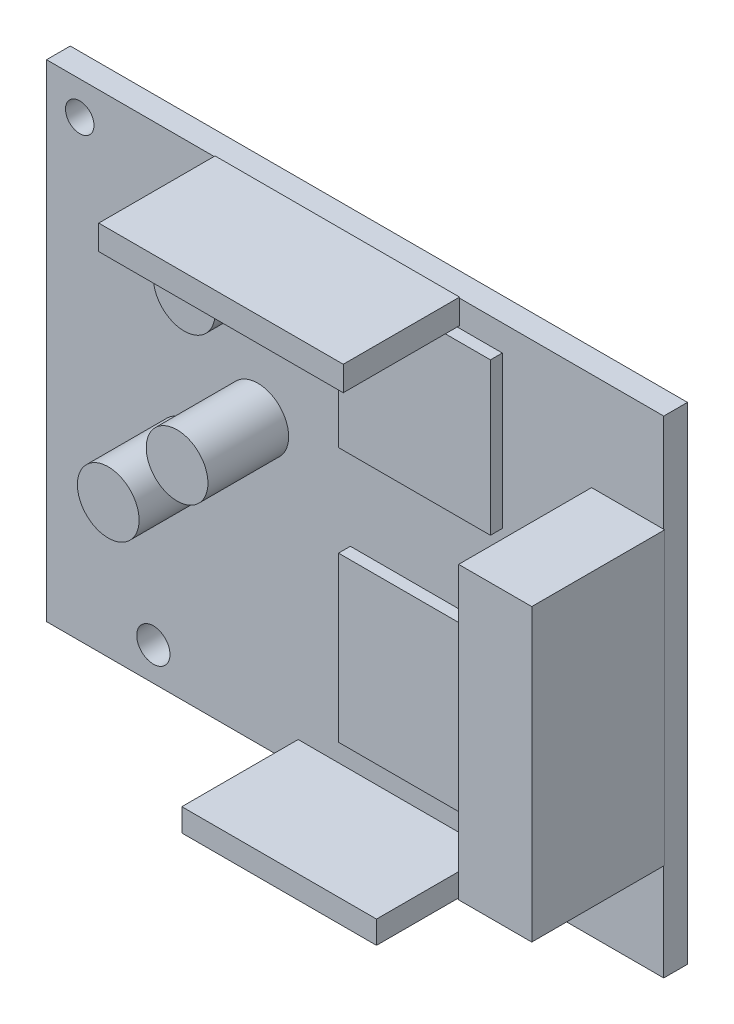
ISO-10303-21;
HEADER;
FILE_DESCRIPTION(('STEP AP214'),'2;1');
FILE_NAME('part.step','',(''),(''),'','','');
FILE_SCHEMA(('AUTOMOTIVE_DESIGN { 1 0 10303 214 1 1 1 1 }'));
ENDSEC;
DATA;
#1=APPLICATION_CONTEXT('core data for automotive mechanical design processes');
#2=APPLICATION_PROTOCOL_DEFINITION('international standard','automotive_design',2000,#1);
#3=PRODUCT_CONTEXT('',#1,'mechanical');
#4=PRODUCT('Part','Part','',(#3));
#5=PRODUCT_RELATED_PRODUCT_CATEGORY('part','',(#4));
#6=PRODUCT_DEFINITION_FORMATION('','',#4);
#7=PRODUCT_DEFINITION_CONTEXT('part definition',#1,'design');
#8=PRODUCT_DEFINITION('design','',#6,#7);
#9=PRODUCT_DEFINITION_SHAPE('','',#8);
#10=(LENGTH_UNIT() NAMED_UNIT(*) SI_UNIT(.MILLI.,.METRE.));
#11=(NAMED_UNIT(*) PLANE_ANGLE_UNIT() SI_UNIT($,.RADIAN.));
#12=(NAMED_UNIT(*) SI_UNIT($,.STERADIAN.) SOLID_ANGLE_UNIT());
#13=UNCERTAINTY_MEASURE_WITH_UNIT(LENGTH_MEASURE(1.E-05),#10,'distance_accuracy_value','');
#14=(GEOMETRIC_REPRESENTATION_CONTEXT(3) GLOBAL_UNCERTAINTY_ASSIGNED_CONTEXT((#13)) GLOBAL_UNIT_ASSIGNED_CONTEXT((#10,
#11,#12)) REPRESENTATION_CONTEXT('',''));
#15=CARTESIAN_POINT('',(0.,0.,0.));
#16=DIRECTION('',(0.,0.,1.));
#17=DIRECTION('',(1.,0.,0.));
#18=AXIS2_PLACEMENT_3D('',#15,#16,#17);
#19=CARTESIAN_POINT('',(0.,0.,0.));
#20=DIRECTION('',(0.,0.,1.));
#21=DIRECTION('',(1.,0.,0.));
#22=AXIS2_PLACEMENT_3D('',#19,#20,#21);
#23=PLANE('',#22);
#24=DIRECTION('',(1.,0.,0.));
#25=VECTOR('',#24,1.);
#26=CARTESIAN_POINT('',(-0.499999999999998,6.875,0.));
#27=LINE('',#26,#25);
#28=CARTESIAN_POINT('',(-0.499999999999998,6.875,0.));
#29=VERTEX_POINT('',#28);
#30=CARTESIAN_POINT('',(15.5,6.875,0.));
#31=VERTEX_POINT('',#30);
#32=EDGE_CURVE('E235',#29,#31,#27,.T.);
#33=ORIENTED_EDGE('',*,*,#32,.F.);
#34=DIRECTION('',(0.,-1.,0.));
#35=VECTOR('',#34,1.);
#36=CARTESIAN_POINT('',(-0.5,22.875,0.));
#37=LINE('',#36,#35);
#38=CARTESIAN_POINT('',(-0.5,22.875,0.));
#39=VERTEX_POINT('',#38);
#40=EDGE_CURVE('E232',#39,#29,#37,.T.);
#41=ORIENTED_EDGE('',*,*,#40,.F.);
#42=DIRECTION('',(-1.,0.,0.));
#43=VECTOR('',#42,1.);
#44=CARTESIAN_POINT('',(-0.5,22.875,0.));
#45=LINE('',#44,#43);
#46=CARTESIAN_POINT('',(15.5,22.875,0.));
#47=VERTEX_POINT('',#46);
#48=EDGE_CURVE('E244',#47,#39,#45,.T.);
#49=ORIENTED_EDGE('',*,*,#48,.F.);
#50=DIRECTION('',(0.,1.,0.));
#51=VECTOR('',#50,1.);
#52=CARTESIAN_POINT('',(15.5,22.875,0.));
#53=LINE('',#52,#51);
#54=EDGE_CURVE('E252',#31,#47,#53,.T.);
#55=ORIENTED_EDGE('',*,*,#54,.F.);
#56=EDGE_LOOP('',(#33,#41,#49,#55));
#57=FACE_BOUND('',#56,.T.);
#58=CARTESIAN_POINT('',(-21.25,-22.125,0.));
#59=DIRECTION('',(0.,0.,1.));
#60=DIRECTION('',(1.,0.,0.));
#61=AXIS2_PLACEMENT_3D('',#58,#59,#60);
#62=CIRCLE('',#61,1.75);
#63=CARTESIAN_POINT('',(-19.5,-22.125,0.));
#64=VERTEX_POINT('',#63);
#65=EDGE_CURVE('E263',#64,#64,#62,.T.);
#66=ORIENTED_EDGE('',*,*,#65,.F.);
#67=EDGE_LOOP('',(#66));
#68=FACE_BOUND('',#67,.T.);
#69=CARTESIAN_POINT('',(-29.,22.125,0.));
#70=DIRECTION('',(0.,0.,1.));
#71=DIRECTION('',(1.,0.,0.));
#72=AXIS2_PLACEMENT_3D('',#69,#70,#71);
#73=CIRCLE('',#72,1.50000000000003);
#74=CARTESIAN_POINT('',(-27.5,22.125,0.));
#75=VERTEX_POINT('',#74);
#76=EDGE_CURVE('E267',#75,#75,#73,.T.);
#77=ORIENTED_EDGE('',*,*,#76,.F.);
#78=EDGE_LOOP('',(#77));
#79=FACE_BOUND('',#78,.T.);
#80=DIRECTION('',(1.,0.,0.));
#81=VECTOR('',#80,1.);
#82=CARTESIAN_POINT('',(32.5,-25.625,0.));
#83=LINE('',#82,#81);
#84=CARTESIAN_POINT('',(-32.5,-25.625,0.));
#85=VERTEX_POINT('',#84);
#86=CARTESIAN_POINT('',(32.5,-25.625,0.));
#87=VERTEX_POINT('',#86);
#88=EDGE_CURVE('E417',#85,#87,#83,.T.);
#89=ORIENTED_EDGE('',*,*,#88,.T.);
#90=DIRECTION('',(0.,1.,0.));
#91=VECTOR('',#90,1.);
#92=CARTESIAN_POINT('',(32.5,-25.625,0.));
#93=LINE('',#92,#91);
#94=CARTESIAN_POINT('',(32.5,-15.3,0.));
#95=VERTEX_POINT('',#94);
#96=EDGE_CURVE('E420',#87,#95,#93,.T.);
#97=ORIENTED_EDGE('',*,*,#96,.T.);
#98=DIRECTION('',(1.,0.,0.));
#99=VECTOR('',#98,1.);
#100=CARTESIAN_POINT('',(32.5,-15.3,0.));
#101=LINE('',#100,#99);
#102=CARTESIAN_POINT('',(24.9,-15.3,0.));
#103=VERTEX_POINT('',#102);
#104=EDGE_CURVE('E390',#103,#95,#101,.T.);
#105=ORIENTED_EDGE('',*,*,#104,.F.);
#106=DIRECTION('',(0.,-1.,0.));
#107=VECTOR('',#106,1.);
#108=CARTESIAN_POINT('',(24.9,-15.3,0.));
#109=LINE('',#108,#107);
#110=CARTESIAN_POINT('',(24.9,15.3,0.));
#111=VERTEX_POINT('',#110);
#112=EDGE_CURVE('E376',#111,#103,#109,.T.);
#113=ORIENTED_EDGE('',*,*,#112,.F.);
#114=DIRECTION('',(-1.,0.,0.));
#115=VECTOR('',#114,1.);
#116=CARTESIAN_POINT('',(32.5,15.3,0.));
#117=LINE('',#116,#115);
#118=CARTESIAN_POINT('',(32.5,15.3,0.));
#119=VERTEX_POINT('',#118);
#120=EDGE_CURVE('E383',#119,#111,#117,.T.);
#121=ORIENTED_EDGE('',*,*,#120,.F.);
#122=CARTESIAN_POINT('',(32.5,25.625,0.));
#123=VERTEX_POINT('',#122);
#124=EDGE_CURVE('E419',#119,#123,#93,.T.);
#125=ORIENTED_EDGE('',*,*,#124,.T.);
#126=DIRECTION('',(-1.,0.,0.));
#127=VECTOR('',#126,1.);
#128=CARTESIAN_POINT('',(32.5,25.625,0.));
#129=LINE('',#128,#127);
#130=CARTESIAN_POINT('',(11.,25.625,0.));
#131=VERTEX_POINT('',#130);
#132=EDGE_CURVE('E405',#123,#131,#129,.T.);
#133=ORIENTED_EDGE('',*,*,#132,.T.);
#134=DIRECTION('',(0.,1.,0.));
#135=VECTOR('',#134,1.);
#136=CARTESIAN_POINT('',(11.,25.625,0.));
#137=LINE('',#136,#135);
#138=CARTESIAN_POINT('',(11.,23.125,0.));
#139=VERTEX_POINT('',#138);
#140=EDGE_CURVE('E355',#139,#131,#137,.T.);
#141=ORIENTED_EDGE('',*,*,#140,.F.);
#142=DIRECTION('',(1.,0.,0.));
#143=VECTOR('',#142,1.);
#144=CARTESIAN_POINT('',(-14.75,23.125,0.));
#145=LINE('',#144,#143);
#146=CARTESIAN_POINT('',(-14.75,23.125,0.));
#147=VERTEX_POINT('',#146);
#148=EDGE_CURVE('E362',#147,#139,#145,.T.);
#149=ORIENTED_EDGE('',*,*,#148,.F.);
#150=DIRECTION('',(0.,-1.,0.));
#151=VECTOR('',#150,1.);
#152=CARTESIAN_POINT('',(-14.75,25.625,0.));
#153=LINE('',#152,#151);
#154=CARTESIAN_POINT('',(-14.75,25.625,0.));
#155=VERTEX_POINT('',#154);
#156=EDGE_CURVE('E348',#155,#147,#153,.T.);
#157=ORIENTED_EDGE('',*,*,#156,.F.);
#158=CARTESIAN_POINT('',(-32.5,25.625,0.));
#159=VERTEX_POINT('',#158);
#160=EDGE_CURVE('E423',#155,#159,#129,.T.);
#161=ORIENTED_EDGE('',*,*,#160,.T.);
#162=DIRECTION('',(0.,-1.,0.));
#163=VECTOR('',#162,1.);
#164=CARTESIAN_POINT('',(-32.5,-25.625,0.));
#165=LINE('',#164,#163);
#166=EDGE_CURVE('E400',#159,#85,#165,.T.);
#167=ORIENTED_EDGE('',*,*,#166,.T.);
#168=EDGE_LOOP('',(#89,#97,#105,#113,#121,#125,#133,#141,#149,#157,#161,#167));
#169=FACE_BOUND('',#168,.T.);
#170=CARTESIAN_POINT('',(-9.5,19.87,0.));
#171=DIRECTION('',(0.,0.,1.));
#172=DIRECTION('',(1.,0.,0.));
#173=AXIS2_PLACEMENT_3D('',#170,#171,#172);
#174=CIRCLE('',#173,3.25);
#175=CARTESIAN_POINT('',(-6.25,19.87,0.));
#176=VERTEX_POINT('',#175);
#177=EDGE_CURVE('E344',#176,#176,#174,.T.);
#178=ORIENTED_EDGE('',*,*,#177,.F.);
#179=EDGE_LOOP('',(#178));
#180=FACE_BOUND('',#179,.T.);
#181=CARTESIAN_POINT('',(-10.25,4.,0.));
#182=DIRECTION('',(0.,0.,1.));
#183=DIRECTION('',(1.,0.,0.));
#184=AXIS2_PLACEMENT_3D('',#181,#182,#183);
#185=CIRCLE('',#184,3.25);
#186=CARTESIAN_POINT('',(-7.,4.,0.));
#187=VERTEX_POINT('',#186);
#188=EDGE_CURVE('E372',#187,#187,#185,.T.);
#189=ORIENTED_EDGE('',*,*,#188,.F.);
#190=EDGE_LOOP('',(#189));
#191=FACE_BOUND('',#190,.T.);
#192=CARTESIAN_POINT('',(-17.5,-3.,0.));
#193=DIRECTION('',(0.,0.,1.));
#194=DIRECTION('',(1.,0.,0.));
#195=AXIS2_PLACEMENT_3D('',#192,#193,#194);
#196=CIRCLE('',#195,3.25);
#197=CARTESIAN_POINT('',(-14.25,-3.,0.));
#198=VERTEX_POINT('',#197);
#199=EDGE_CURVE('E41',#198,#198,#196,.T.);
#200=ORIENTED_EDGE('',*,*,#199,.F.);
#201=EDGE_LOOP('',(#200));
#202=FACE_BOUND('',#201,.T.);
#203=DIRECTION('',(1.,0.,0.));
#204=VECTOR('',#203,1.);
#205=CARTESIAN_POINT('',(-6.,-25.525,0.));
#206=LINE('',#205,#204);
#207=CARTESIAN_POINT('',(-6.,-25.525,0.));
#208=VERTEX_POINT('',#207);
#209=CARTESIAN_POINT('',(14.5,-25.525,0.));
#210=VERTEX_POINT('',#209);
#211=EDGE_CURVE('E317',#208,#210,#206,.T.);
#212=ORIENTED_EDGE('',*,*,#211,.F.);
#213=DIRECTION('',(0.,-1.,0.));
#214=VECTOR('',#213,1.);
#215=CARTESIAN_POINT('',(-6.,-23.125,0.));
#216=LINE('',#215,#214);
#217=CARTESIAN_POINT('',(-6.,-23.125,0.));
#218=VERTEX_POINT('',#217);
#219=EDGE_CURVE('E323',#218,#208,#216,.T.);
#220=ORIENTED_EDGE('',*,*,#219,.F.);
#221=DIRECTION('',(-1.,0.,0.));
#222=VECTOR('',#221,1.);
#223=CARTESIAN_POINT('',(-6.,-23.125,0.));
#224=LINE('',#223,#222);
#225=CARTESIAN_POINT('',(14.5,-23.125,0.));
#226=VERTEX_POINT('',#225);
#227=EDGE_CURVE('E328',#226,#218,#224,.T.);
#228=ORIENTED_EDGE('',*,*,#227,.F.);
#229=DIRECTION('',(0.,1.,0.));
#230=VECTOR('',#229,1.);
#231=CARTESIAN_POINT('',(14.5,-23.125,0.));
#232=LINE('',#231,#230);
#233=EDGE_CURVE('E335',#210,#226,#232,.T.);
#234=ORIENTED_EDGE('',*,*,#233,.F.);
#235=EDGE_LOOP('',(#212,#220,#228,#234));
#236=FACE_BOUND('',#235,.T.);
#237=DIRECTION('',(1.,0.,0.));
#238=VECTOR('',#237,1.);
#239=CARTESIAN_POINT('',(-0.499999999999998,-20.,0.));
#240=LINE('',#239,#238);
#241=CARTESIAN_POINT('',(-0.499999999999998,-20.,0.));
#242=VERTEX_POINT('',#241);
#243=CARTESIAN_POINT('',(15.5,-20.,0.));
#244=VERTEX_POINT('',#243);
#245=EDGE_CURVE('E447',#242,#244,#240,.T.);
#246=ORIENTED_EDGE('',*,*,#245,.F.);
#247=DIRECTION('',(0.,-1.,0.));
#248=VECTOR('',#247,1.);
#249=CARTESIAN_POINT('',(-0.5,-2.75,0.));
#250=LINE('',#249,#248);
#251=CARTESIAN_POINT('',(-0.5,-2.75,0.));
#252=VERTEX_POINT('',#251);
#253=EDGE_CURVE('E230',#252,#242,#250,.T.);
#254=ORIENTED_EDGE('',*,*,#253,.F.);
#255=DIRECTION('',(-1.,0.,0.));
#256=VECTOR('',#255,1.);
#257=CARTESIAN_POINT('',(-0.5,-2.75,0.));
#258=LINE('',#257,#256);
#259=CARTESIAN_POINT('',(15.5,-2.75,0.));
#260=VERTEX_POINT('',#259);
#261=EDGE_CURVE('E226',#260,#252,#258,.T.);
#262=ORIENTED_EDGE('',*,*,#261,.F.);
#263=DIRECTION('',(0.,1.,0.));
#264=VECTOR('',#263,1.);
#265=CARTESIAN_POINT('',(15.5,-2.75,0.));
#266=LINE('',#265,#264);
#267=EDGE_CURVE('E449',#244,#260,#266,.T.);
#268=ORIENTED_EDGE('',*,*,#267,.F.);
#269=EDGE_LOOP('',(#246,#254,#262,#268));
#270=FACE_BOUND('',#269,.T.);
#271=ADVANCED_FACE('F33',(#57,#68,#79,#169,#180,#191,#202,#236,#270),#23,.T.);
#272=CARTESIAN_POINT('',(-6.,-23.125,12.25));
#273=DIRECTION('',(1.,0.,0.));
#274=DIRECTION('',(0.,0.,-1.));
#275=AXIS2_PLACEMENT_3D('',#272,#273,#274);
#276=PLANE('',#275);
#277=DIRECTION('',(0.,0.,-1.));
#278=VECTOR('',#277,1.);
#279=CARTESIAN_POINT('',(-6.,-25.525,12.25));
#280=LINE('',#279,#278);
#281=CARTESIAN_POINT('',(-6.,-25.525,12.25));
#282=VERTEX_POINT('',#281);
#283=EDGE_CURVE('E314',#282,#208,#280,.T.);
#284=ORIENTED_EDGE('',*,*,#283,.F.);
#285=DIRECTION('',(0.,-1.,0.));
#286=VECTOR('',#285,1.);
#287=CARTESIAN_POINT('',(-6.,-23.125,12.25));
#288=LINE('',#287,#286);
#289=CARTESIAN_POINT('',(-6.,-23.125,12.25));
#290=VERTEX_POINT('',#289);
#291=EDGE_CURVE('E324',#290,#282,#288,.T.);
#292=ORIENTED_EDGE('',*,*,#291,.F.);
#293=DIRECTION('',(0.,0.,-1.));
#294=VECTOR('',#293,1.);
#295=CARTESIAN_POINT('',(-6.,-23.125,12.25));
#296=LINE('',#295,#294);
#297=EDGE_CURVE('E332',#290,#218,#296,.T.);
#298=ORIENTED_EDGE('',*,*,#297,.T.);
#299=ORIENTED_EDGE('',*,*,#219,.T.);
#300=EDGE_LOOP('',(#284,#292,#298,#299));
#301=FACE_BOUND('',#300,.T.);
#302=ADVANCED_FACE('F441',(#301),#276,.F.);
#303=CARTESIAN_POINT('',(14.5,-23.125,12.25));
#304=DIRECTION('',(-1.,0.,0.));
#305=DIRECTION('',(0.,-1.,0.));
#306=AXIS2_PLACEMENT_3D('',#303,#304,#305);
#307=PLANE('',#306);
#308=DIRECTION('',(0.,0.,1.));
#309=VECTOR('',#308,1.);
#310=CARTESIAN_POINT('',(14.5,-25.525,12.25));
#311=LINE('',#310,#309);
#312=CARTESIAN_POINT('',(14.5,-25.525,12.25));
#313=VERTEX_POINT('',#312);
#314=EDGE_CURVE('E319',#210,#313,#311,.T.);
#315=ORIENTED_EDGE('',*,*,#314,.F.);
#316=ORIENTED_EDGE('',*,*,#233,.T.);
#317=DIRECTION('',(0.,0.,-1.));
#318=VECTOR('',#317,1.);
#319=CARTESIAN_POINT('',(14.5,-23.125,12.25));
#320=LINE('',#319,#318);
#321=CARTESIAN_POINT('',(14.5,-23.125,12.25));
#322=VERTEX_POINT('',#321);
#323=EDGE_CURVE('E341',#322,#226,#320,.T.);
#324=ORIENTED_EDGE('',*,*,#323,.F.);
#325=DIRECTION('',(0.,1.,0.));
#326=VECTOR('',#325,1.);
#327=CARTESIAN_POINT('',(14.5,-23.125,12.25));
#328=LINE('',#327,#326);
#329=EDGE_CURVE('E327',#313,#322,#328,.T.);
#330=ORIENTED_EDGE('',*,*,#329,.F.);
#331=EDGE_LOOP('',(#315,#316,#324,#330));
#332=FACE_BOUND('',#331,.T.);
#333=ADVANCED_FACE('F525',(#332),#307,.F.);
#334=CARTESIAN_POINT('',(0.,0.,12.25));
#335=DIRECTION('',(0.,0.,1.));
#336=DIRECTION('',(1.,0.,0.));
#337=AXIS2_PLACEMENT_3D('',#334,#335,#336);
#338=PLANE('',#337);
#339=ORIENTED_EDGE('',*,*,#291,.T.);
#340=DIRECTION('',(-1.,0.,0.));
#341=VECTOR('',#340,1.);
#342=CARTESIAN_POINT('',(-6.,-25.525,12.25));
#343=LINE('',#342,#341);
#344=EDGE_CURVE('E321',#313,#282,#343,.T.);
#345=ORIENTED_EDGE('',*,*,#344,.F.);
#346=ORIENTED_EDGE('',*,*,#329,.T.);
#347=DIRECTION('',(-1.,0.,0.));
#348=VECTOR('',#347,1.);
#349=CARTESIAN_POINT('',(-6.,-23.125,12.25));
#350=LINE('',#349,#348);
#351=EDGE_CURVE('E330',#322,#290,#350,.T.);
#352=ORIENTED_EDGE('',*,*,#351,.T.);
#353=EDGE_LOOP('',(#339,#345,#346,#352));
#354=FACE_BOUND('',#353,.T.);
#355=ADVANCED_FACE('F522',(#354),#338,.T.);
#356=CARTESIAN_POINT('',(-17.5,-3.,8.5));
#357=DIRECTION('',(0.,0.,-1.));
#358=DIRECTION('',(-1.,0.,0.));
#359=AXIS2_PLACEMENT_3D('',#356,#357,#358);
#360=CYLINDRICAL_SURFACE('',#359,3.25);
#361=CARTESIAN_POINT('',(-17.5,-3.,8.5));
#362=DIRECTION('',(0.,0.,1.));
#363=DIRECTION('',(1.,0.,0.));
#364=AXIS2_PLACEMENT_3D('',#361,#362,#363);
#365=CIRCLE('',#364,3.25);
#366=CARTESIAN_POINT('',(-14.25,-3.,8.5));
#367=VERTEX_POINT('',#366);
#368=EDGE_CURVE('E11',#367,#367,#365,.T.);
#369=ORIENTED_EDGE('',*,*,#368,.F.);
#370=EDGE_LOOP('',(#369));
#371=FACE_BOUND('',#370,.T.);
#372=ORIENTED_EDGE('',*,*,#199,.T.);
#373=EDGE_LOOP('',(#372));
#374=FACE_BOUND('',#373,.T.);
#375=ADVANCED_FACE('F35',(#371,#374),#360,.T.);
#376=CARTESIAN_POINT('',(-17.5,-3.,8.5));
#377=DIRECTION('',(0.,0.,1.));
#378=DIRECTION('',(1.,0.,0.));
#379=AXIS2_PLACEMENT_3D('',#376,#377,#378);
#380=PLANE('',#379);
#381=ORIENTED_EDGE('',*,*,#368,.T.);
#382=EDGE_LOOP('',(#381));
#383=FACE_BOUND('',#382,.T.);
#384=ADVANCED_FACE('F602',(#383),#380,.T.);
#385=CARTESIAN_POINT('',(-32.5,-25.625,-2.5));
#386=DIRECTION('',(-1.,0.,0.));
#387=DIRECTION('',(0.,0.,1.));
#388=AXIS2_PLACEMENT_3D('',#385,#386,#387);
#389=PLANE('',#388);
#390=ORIENTED_EDGE('',*,*,#166,.F.);
#391=DIRECTION('',(0.,0.,1.));
#392=VECTOR('',#391,1.);
#393=CARTESIAN_POINT('',(-32.5,25.625,-2.5));
#394=LINE('',#393,#392);
#395=CARTESIAN_POINT('',(-32.5,25.625,-2.5));
#396=VERTEX_POINT('',#395);
#397=EDGE_CURVE('E426',#396,#159,#394,.T.);
#398=ORIENTED_EDGE('',*,*,#397,.F.);
#399=DIRECTION('',(0.,-1.,0.));
#400=VECTOR('',#399,1.);
#401=CARTESIAN_POINT('',(-32.5,-25.625,-2.5));
#402=LINE('',#401,#400);
#403=CARTESIAN_POINT('',(-32.5,-25.625,-2.5));
#404=VERTEX_POINT('',#403);
#405=EDGE_CURVE('E401',#396,#404,#402,.T.);
#406=ORIENTED_EDGE('',*,*,#405,.T.);
#407=DIRECTION('',(0.,0.,1.));
#408=VECTOR('',#407,1.);
#409=CARTESIAN_POINT('',(-32.5,-25.625,-2.5));
#410=LINE('',#409,#408);
#411=EDGE_CURVE('E414',#404,#85,#410,.T.);
#412=ORIENTED_EDGE('',*,*,#411,.T.);
#413=EDGE_LOOP('',(#390,#398,#406,#412));
#414=FACE_BOUND('',#413,.T.);
#415=ADVANCED_FACE('F593',(#414),#389,.T.);
#416=CARTESIAN_POINT('',(32.5,25.625,-2.5));
#417=DIRECTION('',(0.,1.,0.));
#418=DIRECTION('',(0.,0.,1.));
#419=AXIS2_PLACEMENT_3D('',#416,#417,#418);
#420=PLANE('',#419);
#421=DIRECTION('',(-1.,0.,0.));
#422=VECTOR('',#421,1.);
#423=CARTESIAN_POINT('',(11.,25.625,0.));
#424=LINE('',#423,#422);
#425=EDGE_CURVE('E294',#131,#155,#424,.T.);
#426=ORIENTED_EDGE('',*,*,#425,.F.);
#427=ORIENTED_EDGE('',*,*,#132,.F.);
#428=DIRECTION('',(0.,0.,1.));
#429=VECTOR('',#428,1.);
#430=CARTESIAN_POINT('',(32.5,25.625,-2.5));
#431=LINE('',#430,#429);
#432=CARTESIAN_POINT('',(32.5,25.625,-2.5));
#433=VERTEX_POINT('',#432);
#434=EDGE_CURVE('E429',#433,#123,#431,.T.);
#435=ORIENTED_EDGE('',*,*,#434,.F.);
#436=DIRECTION('',(-1.,0.,0.));
#437=VECTOR('',#436,1.);
#438=CARTESIAN_POINT('',(32.5,25.625,-2.5));
#439=LINE('',#438,#437);
#440=EDGE_CURVE('E411',#433,#396,#439,.T.);
#441=ORIENTED_EDGE('',*,*,#440,.T.);
#442=ORIENTED_EDGE('',*,*,#397,.T.);
#443=ORIENTED_EDGE('',*,*,#160,.F.);
#444=EDGE_LOOP('',(#426,#427,#435,#441,#442,#443));
#445=FACE_BOUND('',#444,.T.);
#446=ADVANCED_FACE('F589',(#445),#420,.T.);
#447=CARTESIAN_POINT('',(32.5,-25.625,-2.5));
#448=DIRECTION('',(1.,0.,0.));
#449=DIRECTION('',(0.,0.,-1.));
#450=AXIS2_PLACEMENT_3D('',#447,#448,#449);
#451=PLANE('',#450);
#452=DIRECTION('',(0.,1.,0.));
#453=VECTOR('',#452,1.);
#454=CARTESIAN_POINT('',(32.5,15.3,0.));
#455=LINE('',#454,#453);
#456=EDGE_CURVE('E273',#95,#119,#455,.T.);
#457=ORIENTED_EDGE('',*,*,#456,.F.);
#458=ORIENTED_EDGE('',*,*,#96,.F.);
#459=DIRECTION('',(0.,0.,1.));
#460=VECTOR('',#459,1.);
#461=CARTESIAN_POINT('',(32.5,-25.625,-2.5));
#462=LINE('',#461,#460);
#463=CARTESIAN_POINT('',(32.5,-25.625,-2.5));
#464=VERTEX_POINT('',#463);
#465=EDGE_CURVE('E432',#464,#87,#462,.T.);
#466=ORIENTED_EDGE('',*,*,#465,.F.);
#467=DIRECTION('',(0.,1.,0.));
#468=VECTOR('',#467,1.);
#469=CARTESIAN_POINT('',(32.5,-25.625,-2.5));
#470=LINE('',#469,#468);
#471=EDGE_CURVE('E408',#464,#433,#470,.T.);
#472=ORIENTED_EDGE('',*,*,#471,.T.);
#473=ORIENTED_EDGE('',*,*,#434,.T.);
#474=ORIENTED_EDGE('',*,*,#124,.F.);
#475=EDGE_LOOP('',(#457,#458,#466,#472,#473,#474));
#476=FACE_BOUND('',#475,.T.);
#477=ADVANCED_FACE('F592',(#476),#451,.T.);
#478=CARTESIAN_POINT('',(32.5,-25.625,-2.5));
#479=DIRECTION('',(0.,-1.,0.));
#480=DIRECTION('',(0.,0.,-1.));
#481=AXIS2_PLACEMENT_3D('',#478,#479,#480);
#482=PLANE('',#481);
#483=ORIENTED_EDGE('',*,*,#465,.T.);
#484=ORIENTED_EDGE('',*,*,#88,.F.);
#485=ORIENTED_EDGE('',*,*,#411,.F.);
#486=DIRECTION('',(1.,0.,0.));
#487=VECTOR('',#486,1.);
#488=CARTESIAN_POINT('',(32.5,-25.625,-2.5));
#489=LINE('',#488,#487);
#490=EDGE_CURVE('E404',#404,#464,#489,.T.);
#491=ORIENTED_EDGE('',*,*,#490,.T.);
#492=EDGE_LOOP('',(#483,#484,#485,#491));
#493=FACE_BOUND('',#492,.T.);
#494=ADVANCED_FACE('F586',(#493),#482,.T.);
#495=CARTESIAN_POINT('',(0.,0.,-2.5));
#496=DIRECTION('',(0.,0.,1.));
#497=DIRECTION('',(1.,0.,0.));
#498=AXIS2_PLACEMENT_3D('',#495,#496,#497);
#499=PLANE('',#498);
#500=CARTESIAN_POINT('',(-21.25,-22.125,-2.5));
#501=DIRECTION('',(0.,0.,1.));
#502=DIRECTION('',(1.,0.,0.));
#503=AXIS2_PLACEMENT_3D('',#500,#501,#502);
#504=CIRCLE('',#503,1.75);
#505=CARTESIAN_POINT('',(-19.5,-22.125,-2.5));
#506=VERTEX_POINT('',#505);
#507=EDGE_CURVE('E264',#506,#506,#504,.T.);
#508=ORIENTED_EDGE('',*,*,#507,.T.);
#509=EDGE_LOOP('',(#508));
#510=FACE_BOUND('',#509,.T.);
#511=CARTESIAN_POINT('',(-29.,22.125,-2.5));
#512=DIRECTION('',(0.,0.,1.));
#513=DIRECTION('',(1.,0.,0.));
#514=AXIS2_PLACEMENT_3D('',#511,#512,#513);
#515=CIRCLE('',#514,1.50000000000003);
#516=CARTESIAN_POINT('',(-27.5,22.125,-2.5));
#517=VERTEX_POINT('',#516);
#518=EDGE_CURVE('E270',#517,#517,#515,.T.);
#519=ORIENTED_EDGE('',*,*,#518,.T.);
#520=EDGE_LOOP('',(#519));
#521=FACE_BOUND('',#520,.T.);
#522=ORIENTED_EDGE('',*,*,#405,.F.);
#523=ORIENTED_EDGE('',*,*,#440,.F.);
#524=ORIENTED_EDGE('',*,*,#471,.F.);
#525=ORIENTED_EDGE('',*,*,#490,.F.);
#526=EDGE_LOOP('',(#522,#523,#524,#525));
#527=FACE_BOUND('',#526,.T.);
#528=ADVANCED_FACE('F583',(#510,#521,#527),#499,.F.);
#529=CARTESIAN_POINT('',(24.9,-15.3,14.));
#530=DIRECTION('',(1.,0.,0.));
#531=DIRECTION('',(0.,0.,-1.));
#532=AXIS2_PLACEMENT_3D('',#529,#530,#531);
#533=PLANE('',#532);
#534=ORIENTED_EDGE('',*,*,#112,.T.);
#535=DIRECTION('',(0.,0.,-1.));
#536=VECTOR('',#535,1.);
#537=CARTESIAN_POINT('',(24.9,-15.3,14.));
#538=LINE('',#537,#536);
#539=CARTESIAN_POINT('',(24.9,-15.3,14.));
#540=VERTEX_POINT('',#539);
#541=EDGE_CURVE('E397',#540,#103,#538,.T.);
#542=ORIENTED_EDGE('',*,*,#541,.F.);
#543=DIRECTION('',(0.,-1.,0.));
#544=VECTOR('',#543,1.);
#545=CARTESIAN_POINT('',(24.9,-15.3,14.));
#546=LINE('',#545,#544);
#547=CARTESIAN_POINT('',(24.9,15.3,14.));
#548=VERTEX_POINT('',#547);
#549=EDGE_CURVE('E379',#548,#540,#546,.T.);
#550=ORIENTED_EDGE('',*,*,#549,.F.);
#551=DIRECTION('',(0.,0.,-1.));
#552=VECTOR('',#551,1.);
#553=CARTESIAN_POINT('',(24.9,15.3,14.));
#554=LINE('',#553,#552);
#555=EDGE_CURVE('E387',#548,#111,#554,.T.);
#556=ORIENTED_EDGE('',*,*,#555,.T.);
#557=EDGE_LOOP('',(#534,#542,#550,#556));
#558=FACE_BOUND('',#557,.T.);
#559=ADVANCED_FACE('F579',(#558),#533,.F.);
#560=CARTESIAN_POINT('',(32.5,-15.3,14.));
#561=DIRECTION('',(0.,1.,0.));
#562=DIRECTION('',(-1.,0.,0.));
#563=AXIS2_PLACEMENT_3D('',#560,#561,#562);
#564=PLANE('',#563);
#565=ORIENTED_EDGE('',*,*,#104,.T.);
#566=DIRECTION('',(-1.,0.,0.));
#567=VECTOR('',#566,1.);
#568=CARTESIAN_POINT('',(32.6,-15.3,0.));
#569=LINE('',#568,#567);
#570=CARTESIAN_POINT('',(32.6,-15.3,0.));
#571=VERTEX_POINT('',#570);
#572=EDGE_CURVE('E291',#571,#95,#569,.T.);
#573=ORIENTED_EDGE('',*,*,#572,.F.);
#574=DIRECTION('',(0.,0.,-1.));
#575=VECTOR('',#574,1.);
#576=CARTESIAN_POINT('',(32.6,-15.3,14.));
#577=LINE('',#576,#575);
#578=CARTESIAN_POINT('',(32.6,-15.3,14.));
#579=VERTEX_POINT('',#578);
#580=EDGE_CURVE('E279',#579,#571,#577,.T.);
#581=ORIENTED_EDGE('',*,*,#580,.F.);
#582=DIRECTION('',(1.,0.,0.));
#583=VECTOR('',#582,1.);
#584=CARTESIAN_POINT('',(32.5,-15.3,14.));
#585=LINE('',#584,#583);
#586=EDGE_CURVE('E382',#540,#579,#585,.T.);
#587=ORIENTED_EDGE('',*,*,#586,.F.);
#588=ORIENTED_EDGE('',*,*,#541,.T.);
#589=EDGE_LOOP('',(#565,#573,#581,#587,#588));
#590=FACE_BOUND('',#589,.T.);
#591=ADVANCED_FACE('F575',(#590),#564,.F.);
#592=CARTESIAN_POINT('',(32.5,15.3,14.));
#593=DIRECTION('',(0.,-1.,0.));
#594=DIRECTION('',(1.,0.,0.));
#595=AXIS2_PLACEMENT_3D('',#592,#593,#594);
#596=PLANE('',#595);
#597=ORIENTED_EDGE('',*,*,#120,.T.);
#598=ORIENTED_EDGE('',*,*,#555,.F.);
#599=DIRECTION('',(-1.,0.,0.));
#600=VECTOR('',#599,1.);
#601=CARTESIAN_POINT('',(32.5,15.3,14.));
#602=LINE('',#601,#600);
#603=CARTESIAN_POINT('',(32.6,15.3,14.));
#604=VERTEX_POINT('',#603);
#605=EDGE_CURVE('E385',#604,#548,#602,.T.);
#606=ORIENTED_EDGE('',*,*,#605,.F.);
#607=DIRECTION('',(0.,0.,1.));
#608=VECTOR('',#607,1.);
#609=CARTESIAN_POINT('',(32.6,15.3,14.));
#610=LINE('',#609,#608);
#611=CARTESIAN_POINT('',(32.6,15.3,0.));
#612=VERTEX_POINT('',#611);
#613=EDGE_CURVE('E283',#612,#604,#610,.T.);
#614=ORIENTED_EDGE('',*,*,#613,.F.);
#615=DIRECTION('',(-1.,0.,0.));
#616=VECTOR('',#615,1.);
#617=CARTESIAN_POINT('',(32.6,15.3,0.));
#618=LINE('',#617,#616);
#619=EDGE_CURVE('E286',#612,#119,#618,.T.);
#620=ORIENTED_EDGE('',*,*,#619,.T.);
#621=EDGE_LOOP('',(#597,#598,#606,#614,#620));
#622=FACE_BOUND('',#621,.T.);
#623=ADVANCED_FACE('F571',(#622),#596,.F.);
#624=CARTESIAN_POINT('',(0.,0.,14.));
#625=DIRECTION('',(0.,0.,1.));
#626=DIRECTION('',(1.,0.,0.));
#627=AXIS2_PLACEMENT_3D('',#624,#625,#626);
#628=PLANE('',#627);
#629=ORIENTED_EDGE('',*,*,#549,.T.);
#630=ORIENTED_EDGE('',*,*,#586,.T.);
#631=DIRECTION('',(0.,-1.,0.));
#632=VECTOR('',#631,1.);
#633=CARTESIAN_POINT('',(32.6,15.3,14.));
#634=LINE('',#633,#632);
#635=EDGE_CURVE('E276',#604,#579,#634,.T.);
#636=ORIENTED_EDGE('',*,*,#635,.F.);
#637=ORIENTED_EDGE('',*,*,#605,.T.);
#638=EDGE_LOOP('',(#629,#630,#636,#637));
#639=FACE_BOUND('',#638,.T.);
#640=ADVANCED_FACE('F567',(#639),#628,.T.);
#641=CARTESIAN_POINT('',(-10.25,4.,8.5));
#642=DIRECTION('',(0.,0.,-1.));
#643=DIRECTION('',(-1.,0.,0.));
#644=AXIS2_PLACEMENT_3D('',#641,#642,#643);
#645=CYLINDRICAL_SURFACE('',#644,3.25);
#646=CARTESIAN_POINT('',(-10.25,4.,8.5));
#647=DIRECTION('',(0.,0.,1.));
#648=DIRECTION('',(1.,0.,0.));
#649=AXIS2_PLACEMENT_3D('',#646,#647,#648);
#650=CIRCLE('',#649,3.25);
#651=CARTESIAN_POINT('',(-7.,4.,8.5));
#652=VERTEX_POINT('',#651);
#653=EDGE_CURVE('E373',#652,#652,#650,.T.);
#654=ORIENTED_EDGE('',*,*,#653,.F.);
#655=EDGE_LOOP('',(#654));
#656=FACE_BOUND('',#655,.T.);
#657=ORIENTED_EDGE('',*,*,#188,.T.);
#658=EDGE_LOOP('',(#657));
#659=FACE_BOUND('',#658,.T.);
#660=ADVANCED_FACE('F563',(#656,#659),#645,.T.);
#661=CARTESIAN_POINT('',(-10.25,4.,8.5));
#662=DIRECTION('',(0.,0.,1.));
#663=DIRECTION('',(1.,0.,0.));
#664=AXIS2_PLACEMENT_3D('',#661,#662,#663);
#665=PLANE('',#664);
#666=ORIENTED_EDGE('',*,*,#653,.T.);
#667=EDGE_LOOP('',(#666));
#668=FACE_BOUND('',#667,.T.);
#669=ADVANCED_FACE('F559',(#668),#665,.T.);
#670=CARTESIAN_POINT('',(-14.75,25.625,12.25));
#671=DIRECTION('',(1.,0.,0.));
#672=DIRECTION('',(0.,0.,-1.));
#673=AXIS2_PLACEMENT_3D('',#670,#671,#672);
#674=PLANE('',#673);
#675=ORIENTED_EDGE('',*,*,#156,.T.);
#676=DIRECTION('',(0.,0.,-1.));
#677=VECTOR('',#676,1.);
#678=CARTESIAN_POINT('',(-14.75,23.125,12.25));
#679=LINE('',#678,#677);
#680=CARTESIAN_POINT('',(-14.75,23.125,12.25));
#681=VERTEX_POINT('',#680);
#682=EDGE_CURVE('E369',#681,#147,#679,.T.);
#683=ORIENTED_EDGE('',*,*,#682,.F.);
#684=DIRECTION('',(0.,-1.,0.));
#685=VECTOR('',#684,1.);
#686=CARTESIAN_POINT('',(-14.75,25.625,12.25));
#687=LINE('',#686,#685);
#688=CARTESIAN_POINT('',(-14.75,25.725,12.25));
#689=VERTEX_POINT('',#688);
#690=EDGE_CURVE('E351',#689,#681,#687,.T.);
#691=ORIENTED_EDGE('',*,*,#690,.F.);
#692=DIRECTION('',(0.,0.,1.));
#693=VECTOR('',#692,1.);
#694=CARTESIAN_POINT('',(-14.75,25.725,12.25));
#695=LINE('',#694,#693);
#696=CARTESIAN_POINT('',(-14.75,25.725,0.));
#697=VERTEX_POINT('',#696);
#698=EDGE_CURVE('E300',#697,#689,#695,.T.);
#699=ORIENTED_EDGE('',*,*,#698,.F.);
#700=DIRECTION('',(0.,-1.,0.));
#701=VECTOR('',#700,1.);
#702=CARTESIAN_POINT('',(-14.75,25.725,0.));
#703=LINE('',#702,#701);
#704=EDGE_CURVE('E306',#697,#155,#703,.T.);
#705=ORIENTED_EDGE('',*,*,#704,.T.);
#706=EDGE_LOOP('',(#675,#683,#691,#699,#705));
#707=FACE_BOUND('',#706,.T.);
#708=ADVANCED_FACE('F555',(#707),#674,.F.);
#709=CARTESIAN_POINT('',(-14.75,23.125,12.25));
#710=DIRECTION('',(0.,1.,0.));
#711=DIRECTION('',(0.,0.,1.));
#712=AXIS2_PLACEMENT_3D('',#709,#710,#711);
#713=PLANE('',#712);
#714=ORIENTED_EDGE('',*,*,#148,.T.);
#715=DIRECTION('',(0.,0.,-1.));
#716=VECTOR('',#715,1.);
#717=CARTESIAN_POINT('',(11.,23.125,12.25));
#718=LINE('',#717,#716);
#719=CARTESIAN_POINT('',(11.,23.125,12.25));
#720=VERTEX_POINT('',#719);
#721=EDGE_CURVE('E359',#720,#139,#718,.T.);
#722=ORIENTED_EDGE('',*,*,#721,.F.);
#723=DIRECTION('',(1.,0.,0.));
#724=VECTOR('',#723,1.);
#725=CARTESIAN_POINT('',(-14.75,23.125,12.25));
#726=LINE('',#725,#724);
#727=EDGE_CURVE('E354',#681,#720,#726,.T.);
#728=ORIENTED_EDGE('',*,*,#727,.F.);
#729=ORIENTED_EDGE('',*,*,#682,.T.);
#730=EDGE_LOOP('',(#714,#722,#728,#729));
#731=FACE_BOUND('',#730,.T.);
#732=ADVANCED_FACE('F551',(#731),#713,.F.);
#733=CARTESIAN_POINT('',(11.,25.625,12.25));
#734=DIRECTION('',(-1.,0.,0.));
#735=DIRECTION('',(0.,0.,1.));
#736=AXIS2_PLACEMENT_3D('',#733,#734,#735);
#737=PLANE('',#736);
#738=ORIENTED_EDGE('',*,*,#140,.T.);
#739=DIRECTION('',(0.,-1.,0.));
#740=VECTOR('',#739,1.);
#741=CARTESIAN_POINT('',(11.,25.725,0.));
#742=LINE('',#741,#740);
#743=CARTESIAN_POINT('',(11.,25.725,0.));
#744=VERTEX_POINT('',#743);
#745=EDGE_CURVE('E311',#744,#131,#742,.T.);
#746=ORIENTED_EDGE('',*,*,#745,.F.);
#747=DIRECTION('',(0.,0.,-1.));
#748=VECTOR('',#747,1.);
#749=CARTESIAN_POINT('',(11.,25.725,12.25));
#750=LINE('',#749,#748);
#751=CARTESIAN_POINT('',(11.,25.725,12.25));
#752=VERTEX_POINT('',#751);
#753=EDGE_CURVE('E295',#752,#744,#750,.T.);
#754=ORIENTED_EDGE('',*,*,#753,.F.);
#755=DIRECTION('',(0.,1.,0.));
#756=VECTOR('',#755,1.);
#757=CARTESIAN_POINT('',(11.,25.625,12.25));
#758=LINE('',#757,#756);
#759=EDGE_CURVE('E357',#720,#752,#758,.T.);
#760=ORIENTED_EDGE('',*,*,#759,.F.);
#761=ORIENTED_EDGE('',*,*,#721,.T.);
#762=EDGE_LOOP('',(#738,#746,#754,#760,#761));
#763=FACE_BOUND('',#762,.T.);
#764=ADVANCED_FACE('F547',(#763),#737,.F.);
#765=CARTESIAN_POINT('',(0.,0.,12.25));
#766=DIRECTION('',(0.,0.,1.));
#767=DIRECTION('',(1.,0.,0.));
#768=AXIS2_PLACEMENT_3D('',#765,#766,#767);
#769=PLANE('',#768);
#770=ORIENTED_EDGE('',*,*,#690,.T.);
#771=ORIENTED_EDGE('',*,*,#727,.T.);
#772=ORIENTED_EDGE('',*,*,#759,.T.);
#773=DIRECTION('',(1.,0.,0.));
#774=VECTOR('',#773,1.);
#775=CARTESIAN_POINT('',(11.,25.725,12.25));
#776=LINE('',#775,#774);
#777=EDGE_CURVE('E303',#689,#752,#776,.T.);
#778=ORIENTED_EDGE('',*,*,#777,.F.);
#779=EDGE_LOOP('',(#770,#771,#772,#778));
#780=FACE_BOUND('',#779,.T.);
#781=ADVANCED_FACE('F543',(#780),#769,.T.);
#782=CARTESIAN_POINT('',(-9.5,19.87,8.5));
#783=DIRECTION('',(0.,0.,-1.));
#784=DIRECTION('',(-1.,0.,0.));
#785=AXIS2_PLACEMENT_3D('',#782,#783,#784);
#786=CYLINDRICAL_SURFACE('',#785,3.25);
#787=CARTESIAN_POINT('',(-9.5,19.87,8.5));
#788=DIRECTION('',(0.,0.,1.));
#789=DIRECTION('',(1.,0.,0.));
#790=AXIS2_PLACEMENT_3D('',#787,#788,#789);
#791=CIRCLE('',#790,3.25);
#792=CARTESIAN_POINT('',(-6.25,19.87,8.5));
#793=VERTEX_POINT('',#792);
#794=EDGE_CURVE('E345',#793,#793,#791,.T.);
#795=ORIENTED_EDGE('',*,*,#794,.F.);
#796=EDGE_LOOP('',(#795));
#797=FACE_BOUND('',#796,.T.);
#798=ORIENTED_EDGE('',*,*,#177,.T.);
#799=EDGE_LOOP('',(#798));
#800=FACE_BOUND('',#799,.T.);
#801=ADVANCED_FACE('F539',(#797,#800),#786,.T.);
#802=CARTESIAN_POINT('',(-9.5,19.87,8.5));
#803=DIRECTION('',(0.,0.,1.));
#804=DIRECTION('',(1.,0.,0.));
#805=AXIS2_PLACEMENT_3D('',#802,#803,#804);
#806=PLANE('',#805);
#807=ORIENTED_EDGE('',*,*,#794,.T.);
#808=EDGE_LOOP('',(#807));
#809=FACE_BOUND('',#808,.T.);
#810=ADVANCED_FACE('F529',(#809),#806,.T.);
#811=CARTESIAN_POINT('',(-6.,-23.125,12.25));
#812=DIRECTION('',(0.,-1.,0.));
#813=DIRECTION('',(0.,0.,-1.));
#814=AXIS2_PLACEMENT_3D('',#811,#812,#813);
#815=PLANE('',#814);
#816=ORIENTED_EDGE('',*,*,#227,.T.);
#817=ORIENTED_EDGE('',*,*,#297,.F.);
#818=ORIENTED_EDGE('',*,*,#351,.F.);
#819=ORIENTED_EDGE('',*,*,#323,.T.);
#820=EDGE_LOOP('',(#816,#817,#818,#819));
#821=FACE_BOUND('',#820,.T.);
#822=ADVANCED_FACE('F520',(#821),#815,.F.);
#823=CARTESIAN_POINT('',(0.,-25.525,0.));
#824=DIRECTION('',(0.,-1.,0.));
#825=DIRECTION('',(0.,0.,-1.));
#826=AXIS2_PLACEMENT_3D('',#823,#824,#825);
#827=PLANE('',#826);
#828=ORIENTED_EDGE('',*,*,#283,.T.);
#829=ORIENTED_EDGE('',*,*,#211,.T.);
#830=ORIENTED_EDGE('',*,*,#314,.T.);
#831=ORIENTED_EDGE('',*,*,#344,.T.);
#832=EDGE_LOOP('',(#828,#829,#830,#831));
#833=FACE_BOUND('',#832,.T.);
#834=ADVANCED_FACE('F516',(#833),#827,.T.);
#835=CARTESIAN_POINT('',(11.,25.725,0.));
#836=DIRECTION('',(0.,0.,1.));
#837=DIRECTION('',(1.,0.,0.));
#838=AXIS2_PLACEMENT_3D('',#835,#836,#837);
#839=PLANE('',#838);
#840=ORIENTED_EDGE('',*,*,#425,.T.);
#841=ORIENTED_EDGE('',*,*,#704,.F.);
#842=DIRECTION('',(-1.,0.,0.));
#843=VECTOR('',#842,1.);
#844=CARTESIAN_POINT('',(11.,25.725,0.));
#845=LINE('',#844,#843);
#846=EDGE_CURVE('E298',#744,#697,#845,.T.);
#847=ORIENTED_EDGE('',*,*,#846,.F.);
#848=ORIENTED_EDGE('',*,*,#745,.T.);
#849=EDGE_LOOP('',(#840,#841,#847,#848));
#850=FACE_BOUND('',#849,.T.);
#851=ADVANCED_FACE('F512',(#850),#839,.F.);
#852=CARTESIAN_POINT('',(0.,25.725,0.));
#853=DIRECTION('',(0.,1.,0.));
#854=DIRECTION('',(0.,0.,1.));
#855=AXIS2_PLACEMENT_3D('',#852,#853,#854);
#856=PLANE('',#855);
#857=ORIENTED_EDGE('',*,*,#753,.T.);
#858=ORIENTED_EDGE('',*,*,#846,.T.);
#859=ORIENTED_EDGE('',*,*,#698,.T.);
#860=ORIENTED_EDGE('',*,*,#777,.T.);
#861=EDGE_LOOP('',(#857,#858,#859,#860));
#862=FACE_BOUND('',#861,.T.);
#863=ADVANCED_FACE('F508',(#862),#856,.T.);
#864=CARTESIAN_POINT('',(32.6,15.3,0.));
#865=DIRECTION('',(0.,0.,1.));
#866=DIRECTION('',(1.,0.,0.));
#867=AXIS2_PLACEMENT_3D('',#864,#865,#866);
#868=PLANE('',#867);
#869=ORIENTED_EDGE('',*,*,#456,.T.);
#870=ORIENTED_EDGE('',*,*,#619,.F.);
#871=DIRECTION('',(0.,1.,0.));
#872=VECTOR('',#871,1.);
#873=CARTESIAN_POINT('',(32.6,15.3,0.));
#874=LINE('',#873,#872);
#875=EDGE_CURVE('E281',#571,#612,#874,.T.);
#876=ORIENTED_EDGE('',*,*,#875,.F.);
#877=ORIENTED_EDGE('',*,*,#572,.T.);
#878=EDGE_LOOP('',(#869,#870,#876,#877));
#879=FACE_BOUND('',#878,.T.);
#880=ADVANCED_FACE('F504',(#879),#868,.F.);
#881=CARTESIAN_POINT('',(32.6,0.,0.));
#882=DIRECTION('',(1.,0.,0.));
#883=DIRECTION('',(0.,0.,-1.));
#884=AXIS2_PLACEMENT_3D('',#881,#882,#883);
#885=PLANE('',#884);
#886=ORIENTED_EDGE('',*,*,#635,.T.);
#887=ORIENTED_EDGE('',*,*,#580,.T.);
#888=ORIENTED_EDGE('',*,*,#875,.T.);
#889=ORIENTED_EDGE('',*,*,#613,.T.);
#890=EDGE_LOOP('',(#886,#887,#888,#889));
#891=FACE_BOUND('',#890,.T.);
#892=ADVANCED_FACE('F500',(#891),#885,.T.);
#893=CARTESIAN_POINT('',(-29.,22.125,-2.5));
#894=DIRECTION('',(0.,0.,1.));
#895=DIRECTION('',(1.,0.,0.));
#896=AXIS2_PLACEMENT_3D('',#893,#894,#895);
#897=CYLINDRICAL_SURFACE('',#896,1.50000000000003);
#898=ORIENTED_EDGE('',*,*,#518,.F.);
#899=EDGE_LOOP('',(#898));
#900=FACE_BOUND('',#899,.T.);
#901=ORIENTED_EDGE('',*,*,#76,.T.);
#902=EDGE_LOOP('',(#901));
#903=FACE_BOUND('',#902,.T.);
#904=ADVANCED_FACE('F496',(#900,#903),#897,.F.);
#905=CARTESIAN_POINT('',(-21.25,-22.125,-2.5));
#906=DIRECTION('',(0.,0.,1.));
#907=DIRECTION('',(1.,0.,0.));
#908=AXIS2_PLACEMENT_3D('',#905,#906,#907);
#909=CYLINDRICAL_SURFACE('',#908,1.75);
#910=ORIENTED_EDGE('',*,*,#507,.F.);
#911=EDGE_LOOP('',(#910));
#912=FACE_BOUND('',#911,.T.);
#913=ORIENTED_EDGE('',*,*,#65,.T.);
#914=EDGE_LOOP('',(#913));
#915=FACE_BOUND('',#914,.T.);
#916=ADVANCED_FACE('F492',(#912,#915),#909,.F.);
#917=CARTESIAN_POINT('',(-0.5,22.875,1.25));
#918=DIRECTION('',(1.,0.,0.));
#919=DIRECTION('',(0.,1.,0.));
#920=AXIS2_PLACEMENT_3D('',#917,#918,#919);
#921=PLANE('',#920);
#922=ORIENTED_EDGE('',*,*,#40,.T.);
#923=DIRECTION('',(0.,0.,-1.));
#924=VECTOR('',#923,1.);
#925=CARTESIAN_POINT('',(-0.499999999999998,6.875,1.25));
#926=LINE('',#925,#924);
#927=CARTESIAN_POINT('',(-0.499999999999998,6.875,1.25));
#928=VERTEX_POINT('',#927);
#929=EDGE_CURVE('E261',#928,#29,#926,.T.);
#930=ORIENTED_EDGE('',*,*,#929,.F.);
#931=DIRECTION('',(0.,-1.,0.));
#932=VECTOR('',#931,1.);
#933=CARTESIAN_POINT('',(-0.5,22.875,1.25));
#934=LINE('',#933,#932);
#935=CARTESIAN_POINT('',(-0.5,22.875,1.25));
#936=VERTEX_POINT('',#935);
#937=EDGE_CURVE('E240',#936,#928,#934,.T.);
#938=ORIENTED_EDGE('',*,*,#937,.F.);
#939=DIRECTION('',(0.,0.,-1.));
#940=VECTOR('',#939,1.);
#941=CARTESIAN_POINT('',(-0.5,22.875,1.25));
#942=LINE('',#941,#940);
#943=EDGE_CURVE('E249',#936,#39,#942,.T.);
#944=ORIENTED_EDGE('',*,*,#943,.T.);
#945=EDGE_LOOP('',(#922,#930,#938,#944));
#946=FACE_BOUND('',#945,.T.);
#947=ADVANCED_FACE('F488',(#946),#921,.F.);
#948=CARTESIAN_POINT('',(-0.499999999999998,6.875,1.25));
#949=DIRECTION('',(0.,1.,0.));
#950=DIRECTION('',(0.,0.,1.));
#951=AXIS2_PLACEMENT_3D('',#948,#949,#950);
#952=PLANE('',#951);
#953=ORIENTED_EDGE('',*,*,#32,.T.);
#954=DIRECTION('',(0.,0.,-1.));
#955=VECTOR('',#954,1.);
#956=CARTESIAN_POINT('',(15.5,6.875,1.25));
#957=LINE('',#956,#955);
#958=CARTESIAN_POINT('',(15.5,6.875,1.25));
#959=VERTEX_POINT('',#958);
#960=EDGE_CURVE('E258',#959,#31,#957,.T.);
#961=ORIENTED_EDGE('',*,*,#960,.F.);
#962=DIRECTION('',(1.,0.,0.));
#963=VECTOR('',#962,1.);
#964=CARTESIAN_POINT('',(-0.499999999999998,6.875,1.25));
#965=LINE('',#964,#963);
#966=EDGE_CURVE('E243',#928,#959,#965,.T.);
#967=ORIENTED_EDGE('',*,*,#966,.F.);
#968=ORIENTED_EDGE('',*,*,#929,.T.);
#969=EDGE_LOOP('',(#953,#961,#967,#968));
#970=FACE_BOUND('',#969,.T.);
#971=ADVANCED_FACE('F484',(#970),#952,.F.);
#972=CARTESIAN_POINT('',(15.5,22.875,1.25));
#973=DIRECTION('',(-1.,0.,0.));
#974=DIRECTION('',(0.,-1.,0.));
#975=AXIS2_PLACEMENT_3D('',#972,#973,#974);
#976=PLANE('',#975);
#977=ORIENTED_EDGE('',*,*,#54,.T.);
#978=DIRECTION('',(0.,0.,-1.));
#979=VECTOR('',#978,1.);
#980=CARTESIAN_POINT('',(15.5,22.875,1.25));
#981=LINE('',#980,#979);
#982=CARTESIAN_POINT('',(15.5,22.875,1.25));
#983=VERTEX_POINT('',#982);
#984=EDGE_CURVE('E56',#983,#47,#981,.T.);
#985=ORIENTED_EDGE('',*,*,#984,.F.);
#986=DIRECTION('',(0.,1.,0.));
#987=VECTOR('',#986,1.);
#988=CARTESIAN_POINT('',(15.5,22.875,1.25));
#989=LINE('',#988,#987);
#990=EDGE_CURVE('E246',#959,#983,#989,.T.);
#991=ORIENTED_EDGE('',*,*,#990,.F.);
#992=ORIENTED_EDGE('',*,*,#960,.T.);
#993=EDGE_LOOP('',(#977,#985,#991,#992));
#994=FACE_BOUND('',#993,.T.);
#995=ADVANCED_FACE('F481',(#994),#976,.F.);
#996=CARTESIAN_POINT('',(-0.5,22.875,1.25));
#997=DIRECTION('',(0.,-1.,0.));
#998=DIRECTION('',(0.,0.,-1.));
#999=AXIS2_PLACEMENT_3D('',#996,#997,#998);
#1000=PLANE('',#999);
#1001=ORIENTED_EDGE('',*,*,#48,.T.);
#1002=ORIENTED_EDGE('',*,*,#943,.F.);
#1003=DIRECTION('',(-1.,0.,0.));
#1004=VECTOR('',#1003,1.);
#1005=CARTESIAN_POINT('',(-0.5,22.875,1.25));
#1006=LINE('',#1005,#1004);
#1007=EDGE_CURVE('E248',#983,#936,#1006,.T.);
#1008=ORIENTED_EDGE('',*,*,#1007,.F.);
#1009=ORIENTED_EDGE('',*,*,#984,.T.);
#1010=EDGE_LOOP('',(#1001,#1002,#1008,#1009));
#1011=FACE_BOUND('',#1010,.T.);
#1012=ADVANCED_FACE('F477',(#1011),#1000,.F.);
#1013=CARTESIAN_POINT('',(0.,0.,1.25));
#1014=DIRECTION('',(0.,0.,1.));
#1015=DIRECTION('',(1.,0.,0.));
#1016=AXIS2_PLACEMENT_3D('',#1013,#1014,#1015);
#1017=PLANE('',#1016);
#1018=ORIENTED_EDGE('',*,*,#937,.T.);
#1019=ORIENTED_EDGE('',*,*,#966,.T.);
#1020=ORIENTED_EDGE('',*,*,#990,.T.);
#1021=ORIENTED_EDGE('',*,*,#1007,.T.);
#1022=EDGE_LOOP('',(#1018,#1019,#1020,#1021));
#1023=FACE_BOUND('',#1022,.T.);
#1024=ADVANCED_FACE('F474',(#1023),#1017,.T.);
#1025=CARTESIAN_POINT('',(-0.5,-2.75,1.25));
#1026=DIRECTION('',(1.,0.,0.));
#1027=DIRECTION('',(0.,1.,0.));
#1028=AXIS2_PLACEMENT_3D('',#1025,#1026,#1027);
#1029=PLANE('',#1028);
#1030=ORIENTED_EDGE('',*,*,#253,.T.);
#1031=DIRECTION('',(0.,0.,-1.));
#1032=VECTOR('',#1031,1.);
#1033=CARTESIAN_POINT('',(-0.499999999999998,-20.,1.25));
#1034=LINE('',#1033,#1032);
#1035=CARTESIAN_POINT('',(-0.499999999999998,-20.,1.25));
#1036=VERTEX_POINT('',#1035);
#1037=EDGE_CURVE('E211',#1036,#242,#1034,.T.);
#1038=ORIENTED_EDGE('',*,*,#1037,.F.);
#1039=DIRECTION('',(0.,-1.,0.));
#1040=VECTOR('',#1039,1.);
#1041=CARTESIAN_POINT('',(-0.5,-2.75,1.25));
#1042=LINE('',#1041,#1040);
#1043=CARTESIAN_POINT('',(-0.5,-2.75,1.25));
#1044=VERTEX_POINT('',#1043);
#1045=EDGE_CURVE('E218',#1044,#1036,#1042,.T.);
#1046=ORIENTED_EDGE('',*,*,#1045,.F.);
#1047=DIRECTION('',(0.,0.,-1.));
#1048=VECTOR('',#1047,1.);
#1049=CARTESIAN_POINT('',(-0.5,-2.75,1.25));
#1050=LINE('',#1049,#1048);
#1051=EDGE_CURVE('E456',#1044,#252,#1050,.T.);
#1052=ORIENTED_EDGE('',*,*,#1051,.T.);
#1053=EDGE_LOOP('',(#1030,#1038,#1046,#1052));
#1054=FACE_BOUND('',#1053,.T.);
#1055=ADVANCED_FACE('F228',(#1054),#1029,.F.);
#1056=CARTESIAN_POINT('',(-0.499999999999998,-20.,1.25));
#1057=DIRECTION('',(0.,1.,0.));
#1058=DIRECTION('',(0.,0.,1.));
#1059=AXIS2_PLACEMENT_3D('',#1056,#1057,#1058);
#1060=PLANE('',#1059);
#1061=ORIENTED_EDGE('',*,*,#245,.T.);
#1062=DIRECTION('',(0.,0.,-1.));
#1063=VECTOR('',#1062,1.);
#1064=CARTESIAN_POINT('',(15.5,-20.,1.25));
#1065=LINE('',#1064,#1063);
#1066=CARTESIAN_POINT('',(15.5,-20.,1.25));
#1067=VERTEX_POINT('',#1066);
#1068=EDGE_CURVE('E214',#1067,#244,#1065,.T.);
#1069=ORIENTED_EDGE('',*,*,#1068,.F.);
#1070=DIRECTION('',(1.,0.,0.));
#1071=VECTOR('',#1070,1.);
#1072=CARTESIAN_POINT('',(-0.499999999999998,-20.,1.25));
#1073=LINE('',#1072,#1071);
#1074=EDGE_CURVE('E207',#1036,#1067,#1073,.T.);
#1075=ORIENTED_EDGE('',*,*,#1074,.F.);
#1076=ORIENTED_EDGE('',*,*,#1037,.T.);
#1077=EDGE_LOOP('',(#1061,#1069,#1075,#1076));
#1078=FACE_BOUND('',#1077,.T.);
#1079=ADVANCED_FACE('F209',(#1078),#1060,.F.);
#1080=CARTESIAN_POINT('',(15.5,-2.75,1.25));
#1081=DIRECTION('',(-1.,0.,0.));
#1082=DIRECTION('',(0.,-1.,0.));
#1083=AXIS2_PLACEMENT_3D('',#1080,#1081,#1082);
#1084=PLANE('',#1083);
#1085=ORIENTED_EDGE('',*,*,#267,.T.);
#1086=DIRECTION('',(0.,0.,-1.));
#1087=VECTOR('',#1086,1.);
#1088=CARTESIAN_POINT('',(15.5,-2.75,1.25));
#1089=LINE('',#1088,#1087);
#1090=CARTESIAN_POINT('',(15.5,-2.75,1.25));
#1091=VERTEX_POINT('',#1090);
#1092=EDGE_CURVE('E48',#1091,#260,#1089,.T.);
#1093=ORIENTED_EDGE('',*,*,#1092,.F.);
#1094=DIRECTION('',(0.,1.,0.));
#1095=VECTOR('',#1094,1.);
#1096=CARTESIAN_POINT('',(15.5,-2.75,1.25));
#1097=LINE('',#1096,#1095);
#1098=EDGE_CURVE('E217',#1067,#1091,#1097,.T.);
#1099=ORIENTED_EDGE('',*,*,#1098,.F.);
#1100=ORIENTED_EDGE('',*,*,#1068,.T.);
#1101=EDGE_LOOP('',(#1085,#1093,#1099,#1100));
#1102=FACE_BOUND('',#1101,.T.);
#1103=ADVANCED_FACE('F459',(#1102),#1084,.F.);
#1104=CARTESIAN_POINT('',(-0.5,-2.75,1.25));
#1105=DIRECTION('',(0.,-1.,0.));
#1106=DIRECTION('',(0.,0.,-1.));
#1107=AXIS2_PLACEMENT_3D('',#1104,#1105,#1106);
#1108=PLANE('',#1107);
#1109=ORIENTED_EDGE('',*,*,#261,.T.);
#1110=ORIENTED_EDGE('',*,*,#1051,.F.);
#1111=DIRECTION('',(-1.,0.,0.));
#1112=VECTOR('',#1111,1.);
#1113=CARTESIAN_POINT('',(-0.5,-2.75,1.25));
#1114=LINE('',#1113,#1112);
#1115=EDGE_CURVE('E222',#1091,#1044,#1114,.T.);
#1116=ORIENTED_EDGE('',*,*,#1115,.F.);
#1117=ORIENTED_EDGE('',*,*,#1092,.T.);
#1118=EDGE_LOOP('',(#1109,#1110,#1116,#1117));
#1119=FACE_BOUND('',#1118,.T.);
#1120=ADVANCED_FACE('F460',(#1119),#1108,.F.);
#1121=CARTESIAN_POINT('',(0.,0.,1.25));
#1122=DIRECTION('',(0.,0.,1.));
#1123=DIRECTION('',(1.,0.,0.));
#1124=AXIS2_PLACEMENT_3D('',#1121,#1122,#1123);
#1125=PLANE('',#1124);
#1126=ORIENTED_EDGE('',*,*,#1045,.T.);
#1127=ORIENTED_EDGE('',*,*,#1074,.T.);
#1128=ORIENTED_EDGE('',*,*,#1098,.T.);
#1129=ORIENTED_EDGE('',*,*,#1115,.T.);
#1130=EDGE_LOOP('',(#1126,#1127,#1128,#1129));
#1131=FACE_BOUND('',#1130,.T.);
#1132=ADVANCED_FACE('F221',(#1131),#1125,.T.);
#1133=CLOSED_SHELL('',(#271,#302,#333,#355,#375,#384,#415,#446,#477,#494,#528,#559,#591,#623,
#640,#660,#669,#708,#732,#764,#781,#801,#810,#822,#834,#851,#863,#880,#892,#904,#916,#947,#971,
#995,#1012,#1024,#1055,#1079,#1103,#1120,#1132));
#1134=MANIFOLD_SOLID_BREP('B2',#1133);
#1135=ADVANCED_BREP_SHAPE_REPRESENTATION('',(#18,#1134),#14);
#1136=SHAPE_DEFINITION_REPRESENTATION(#9,#1135);
ENDSEC;
END-ISO-10303-21;
